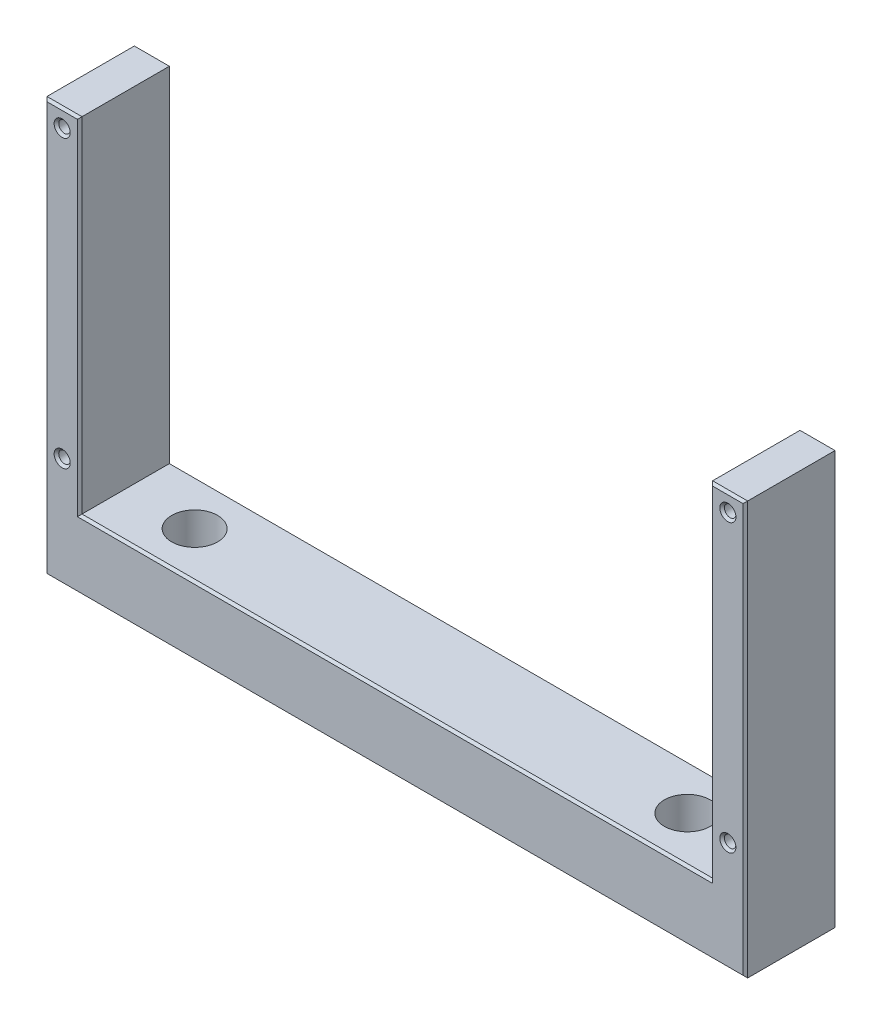
ISO-10303-21;
HEADER;
FILE_DESCRIPTION(('STEP AP214'),'2;1');
FILE_NAME('part.step','',(''),(''),'','','');
FILE_SCHEMA(('AUTOMOTIVE_DESIGN { 1 0 10303 214 1 1 1 1 }'));
ENDSEC;
DATA;
#1=APPLICATION_CONTEXT('core data for automotive mechanical design processes');
#2=APPLICATION_PROTOCOL_DEFINITION('international standard','automotive_design',2000,#1);
#3=PRODUCT_CONTEXT('',#1,'mechanical');
#4=PRODUCT('Part','Part','',(#3));
#5=PRODUCT_RELATED_PRODUCT_CATEGORY('part','',(#4));
#6=PRODUCT_DEFINITION_FORMATION('','',#4);
#7=PRODUCT_DEFINITION_CONTEXT('part definition',#1,'design');
#8=PRODUCT_DEFINITION('design','',#6,#7);
#9=PRODUCT_DEFINITION_SHAPE('','',#8);
#10=(LENGTH_UNIT() NAMED_UNIT(*) SI_UNIT(.MILLI.,.METRE.));
#11=(NAMED_UNIT(*) PLANE_ANGLE_UNIT() SI_UNIT($,.RADIAN.));
#12=(NAMED_UNIT(*) SI_UNIT($,.STERADIAN.) SOLID_ANGLE_UNIT());
#13=UNCERTAINTY_MEASURE_WITH_UNIT(LENGTH_MEASURE(1.E-05),#10,'distance_accuracy_value','');
#14=(GEOMETRIC_REPRESENTATION_CONTEXT(3) GLOBAL_UNCERTAINTY_ASSIGNED_CONTEXT((#13)) GLOBAL_UNIT_ASSIGNED_CONTEXT((#10,
#11,#12)) REPRESENTATION_CONTEXT('',''));
#15=CARTESIAN_POINT('',(0.,0.,0.));
#16=DIRECTION('',(0.,0.,1.));
#17=DIRECTION('',(1.,0.,0.));
#18=AXIS2_PLACEMENT_3D('',#15,#16,#17);
#19=CARTESIAN_POINT('',(-76.2,-54.925,20.));
#20=DIRECTION('',(1.,0.,0.));
#21=DIRECTION('',(0.,0.,-1.));
#22=AXIS2_PLACEMENT_3D('',#19,#20,#21);
#23=PLANE('',#22);
#24=DIRECTION('',(0.,0.,-1.));
#25=VECTOR('',#24,1.);
#26=CARTESIAN_POINT('',(-76.2,-54.925,20.));
#27=LINE('',#26,#25);
#28=CARTESIAN_POINT('',(-76.2,-54.925,19.5));
#29=VERTEX_POINT('',#28);
#30=CARTESIAN_POINT('',(-76.2,-54.925,0.5));
#31=VERTEX_POINT('',#30);
#32=EDGE_CURVE('E330',#29,#31,#27,.T.);
#33=ORIENTED_EDGE('',*,*,#32,.F.);
#34=DIRECTION('',(0.,1.,0.));
#35=VECTOR('',#34,1.);
#36=CARTESIAN_POINT('',(-76.2,-54.925,19.5));
#37=LINE('',#36,#35);
#38=CARTESIAN_POINT('',(-76.2,34.925,19.5));
#39=VERTEX_POINT('',#38);
#40=EDGE_CURVE('E211',#29,#39,#37,.T.);
#41=ORIENTED_EDGE('',*,*,#40,.T.);
#42=DIRECTION('',(0.,0.,-1.));
#43=VECTOR('',#42,1.);
#44=CARTESIAN_POINT('',(-76.2,34.925,20.));
#45=LINE('',#44,#43);
#46=CARTESIAN_POINT('',(-76.2,34.925,0.5));
#47=VERTEX_POINT('',#46);
#48=EDGE_CURVE('E278',#39,#47,#45,.T.);
#49=ORIENTED_EDGE('',*,*,#48,.T.);
#50=DIRECTION('',(0.,-1.,0.));
#51=VECTOR('',#50,1.);
#52=CARTESIAN_POINT('',(-76.2,-54.925,0.5));
#53=LINE('',#52,#51);
#54=EDGE_CURVE('E209',#47,#31,#53,.T.);
#55=ORIENTED_EDGE('',*,*,#54,.T.);
#56=EDGE_LOOP('',(#33,#41,#49,#55));
#57=FACE_BOUND('',#56,.T.);
#58=ADVANCED_FACE('F36',(#57),#23,.F.);
#59=CARTESIAN_POINT('',(76.2,-54.9249999999999,20.));
#60=DIRECTION('',(0.,1.,0.));
#61=DIRECTION('',(-1.,0.,0.));
#62=AXIS2_PLACEMENT_3D('',#59,#60,#61);
#63=PLANE('',#62);
#64=CARTESIAN_POINT('',(-53.5799999999999,-54.9249999999999,9.99999999999999));
#65=DIRECTION('',(0.,1.,0.));
#66=DIRECTION('',(0.,0.,1.));
#67=AXIS2_PLACEMENT_3D('',#64,#65,#66);
#68=CIRCLE('',#67,2.75);
#69=CARTESIAN_POINT('',(-53.5799999999999,-54.9249999999999,12.75));
#70=VERTEX_POINT('',#69);
#71=EDGE_CURVE('E854',#70,#70,#68,.T.);
#72=ORIENTED_EDGE('',*,*,#71,.T.);
#73=EDGE_LOOP('',(#72));
#74=FACE_BOUND('',#73,.T.);
#75=CARTESIAN_POINT('',(53.5799999999999,-54.9249999999999,9.99999999999999));
#76=DIRECTION('',(0.,1.,0.));
#77=DIRECTION('',(0.,0.,1.));
#78=AXIS2_PLACEMENT_3D('',#75,#76,#77);
#79=CIRCLE('',#78,2.75);
#80=CARTESIAN_POINT('',(53.5799999999999,-54.9249999999999,12.75));
#81=VERTEX_POINT('',#80);
#82=EDGE_CURVE('E282',#81,#81,#79,.T.);
#83=ORIENTED_EDGE('',*,*,#82,.T.);
#84=EDGE_LOOP('',(#83));
#85=FACE_BOUND('',#84,.T.);
#86=DIRECTION('',(0.,0.,-1.));
#87=VECTOR('',#86,1.);
#88=CARTESIAN_POINT('',(76.2,-54.9249999999999,20.));
#89=LINE('',#88,#87);
#90=CARTESIAN_POINT('',(76.2,-54.9249999999999,19.5));
#91=VERTEX_POINT('',#90);
#92=CARTESIAN_POINT('',(76.2,-54.9249999999999,0.5));
#93=VERTEX_POINT('',#92);
#94=EDGE_CURVE('E338',#91,#93,#89,.T.);
#95=ORIENTED_EDGE('',*,*,#94,.F.);
#96=DIRECTION('',(-1.,0.,0.));
#97=VECTOR('',#96,1.);
#98=CARTESIAN_POINT('',(76.2,-54.9249999999999,19.5));
#99=LINE('',#98,#97);
#100=EDGE_CURVE('E207',#91,#29,#99,.T.);
#101=ORIENTED_EDGE('',*,*,#100,.T.);
#102=ORIENTED_EDGE('',*,*,#32,.T.);
#103=DIRECTION('',(1.,0.,0.));
#104=VECTOR('',#103,1.);
#105=CARTESIAN_POINT('',(76.2,-54.9249999999999,0.5));
#106=LINE('',#105,#104);
#107=EDGE_CURVE('E204',#31,#93,#106,.T.);
#108=ORIENTED_EDGE('',*,*,#107,.T.);
#109=EDGE_LOOP('',(#95,#101,#102,#108));
#110=FACE_BOUND('',#109,.T.);
#111=ADVANCED_FACE('F334',(#74,#85,#110),#63,.F.);
#112=CARTESIAN_POINT('',(76.2,34.925,20.));
#113=DIRECTION('',(-1.,0.,0.));
#114=DIRECTION('',(0.,-1.,0.));
#115=AXIS2_PLACEMENT_3D('',#112,#113,#114);
#116=PLANE('',#115);
#117=DIRECTION('',(0.,0.,-1.));
#118=VECTOR('',#117,1.);
#119=CARTESIAN_POINT('',(76.2,34.925,20.));
#120=LINE('',#119,#118);
#121=CARTESIAN_POINT('',(76.2,34.925,19.5));
#122=VERTEX_POINT('',#121);
#123=CARTESIAN_POINT('',(76.2,34.925,0.5));
#124=VERTEX_POINT('',#123);
#125=EDGE_CURVE('E343',#122,#124,#120,.T.);
#126=ORIENTED_EDGE('',*,*,#125,.F.);
#127=DIRECTION('',(0.,-1.,0.));
#128=VECTOR('',#127,1.);
#129=CARTESIAN_POINT('',(76.2,34.925,19.5));
#130=LINE('',#129,#128);
#131=EDGE_CURVE('E202',#122,#91,#130,.T.);
#132=ORIENTED_EDGE('',*,*,#131,.T.);
#133=ORIENTED_EDGE('',*,*,#94,.T.);
#134=DIRECTION('',(0.,1.,0.));
#135=VECTOR('',#134,1.);
#136=CARTESIAN_POINT('',(76.2,34.925,0.5));
#137=LINE('',#136,#135);
#138=EDGE_CURVE('E200',#93,#124,#137,.T.);
#139=ORIENTED_EDGE('',*,*,#138,.T.);
#140=EDGE_LOOP('',(#126,#132,#133,#139));
#141=FACE_BOUND('',#140,.T.);
#142=ADVANCED_FACE('F424',(#141),#116,.F.);
#143=CARTESIAN_POINT('',(68.5799999999999,34.925,20.));
#144=DIRECTION('',(0.,-1.,0.));
#145=DIRECTION('',(1.,0.,0.));
#146=AXIS2_PLACEMENT_3D('',#143,#144,#145);
#147=PLANE('',#146);
#148=DIRECTION('',(0.,0.,-1.));
#149=VECTOR('',#148,1.);
#150=CARTESIAN_POINT('',(68.5799999999999,34.925,20.));
#151=LINE('',#150,#149);
#152=CARTESIAN_POINT('',(68.5799999999999,34.925,19.5));
#153=VERTEX_POINT('',#152);
#154=CARTESIAN_POINT('',(68.5799999999999,34.925,0.5));
#155=VERTEX_POINT('',#154);
#156=EDGE_CURVE('E388',#153,#155,#151,.T.);
#157=ORIENTED_EDGE('',*,*,#156,.F.);
#158=DIRECTION('',(1.,0.,0.));
#159=VECTOR('',#158,1.);
#160=CARTESIAN_POINT('',(68.5799999999999,34.925,19.5));
#161=LINE('',#160,#159);
#162=EDGE_CURVE('E198',#153,#122,#161,.T.);
#163=ORIENTED_EDGE('',*,*,#162,.T.);
#164=ORIENTED_EDGE('',*,*,#125,.T.);
#165=DIRECTION('',(-1.,0.,0.));
#166=VECTOR('',#165,1.);
#167=CARTESIAN_POINT('',(68.5799999999999,34.925,0.5));
#168=LINE('',#167,#166);
#169=EDGE_CURVE('E196',#124,#155,#168,.T.);
#170=ORIENTED_EDGE('',*,*,#169,.T.);
#171=EDGE_LOOP('',(#157,#163,#164,#170));
#172=FACE_BOUND('',#171,.T.);
#173=ADVANCED_FACE('F395',(#172),#147,.F.);
#174=CARTESIAN_POINT('',(68.5799999999999,-39.9249999999999,20.));
#175=DIRECTION('',(1.,0.,0.));
#176=DIRECTION('',(0.,0.,-1.));
#177=AXIS2_PLACEMENT_3D('',#174,#175,#176);
#178=PLANE('',#177);
#179=DIRECTION('',(0.,0.,-1.));
#180=VECTOR('',#179,1.);
#181=CARTESIAN_POINT('',(68.5799999999999,-39.9249999999999,20.));
#182=LINE('',#181,#180);
#183=CARTESIAN_POINT('',(68.5799999999999,-39.9249999999999,19.5));
#184=VERTEX_POINT('',#183);
#185=CARTESIAN_POINT('',(68.5799999999999,-39.9249999999999,0.5));
#186=VERTEX_POINT('',#185);
#187=EDGE_CURVE('E381',#184,#186,#182,.T.);
#188=ORIENTED_EDGE('',*,*,#187,.F.);
#189=DIRECTION('',(0.,1.,0.));
#190=VECTOR('',#189,1.);
#191=CARTESIAN_POINT('',(68.5799999999999,-39.9249999999999,19.5));
#192=LINE('',#191,#190);
#193=EDGE_CURVE('E194',#184,#153,#192,.T.);
#194=ORIENTED_EDGE('',*,*,#193,.T.);
#195=ORIENTED_EDGE('',*,*,#156,.T.);
#196=DIRECTION('',(0.,-1.,0.));
#197=VECTOR('',#196,1.);
#198=CARTESIAN_POINT('',(68.5799999999999,-39.9249999999999,0.5));
#199=LINE('',#198,#197);
#200=EDGE_CURVE('E192',#155,#186,#199,.T.);
#201=ORIENTED_EDGE('',*,*,#200,.T.);
#202=EDGE_LOOP('',(#188,#194,#195,#201));
#203=FACE_BOUND('',#202,.T.);
#204=ADVANCED_FACE('F493',(#203),#178,.F.);
#205=CARTESIAN_POINT('',(-68.5799999999999,-39.925,20.));
#206=DIRECTION('',(0.,-1.,0.));
#207=DIRECTION('',(1.,0.,0.));
#208=AXIS2_PLACEMENT_3D('',#205,#206,#207);
#209=PLANE('',#208);
#210=CARTESIAN_POINT('',(-53.5799999999999,-39.9249999999999,9.99999999999999));
#211=DIRECTION('',(0.,1.,0.));
#212=DIRECTION('',(0.,0.,1.));
#213=AXIS2_PLACEMENT_3D('',#210,#211,#212);
#214=CIRCLE('',#213,5.);
#215=CARTESIAN_POINT('',(-53.5799999999999,-39.9249999999999,15.));
#216=VERTEX_POINT('',#215);
#217=EDGE_CURVE('E847',#216,#216,#214,.T.);
#218=ORIENTED_EDGE('',*,*,#217,.F.);
#219=EDGE_LOOP('',(#218));
#220=FACE_BOUND('',#219,.T.);
#221=CARTESIAN_POINT('',(53.5799999999999,-39.9249999999999,9.99999999999999));
#222=DIRECTION('',(0.,1.,0.));
#223=DIRECTION('',(0.,0.,1.));
#224=AXIS2_PLACEMENT_3D('',#221,#222,#223);
#225=CIRCLE('',#224,5.);
#226=CARTESIAN_POINT('',(53.5799999999999,-39.9249999999999,15.));
#227=VERTEX_POINT('',#226);
#228=EDGE_CURVE('E857',#227,#227,#225,.T.);
#229=ORIENTED_EDGE('',*,*,#228,.F.);
#230=EDGE_LOOP('',(#229));
#231=FACE_BOUND('',#230,.T.);
#232=DIRECTION('',(0.,0.,-1.));
#233=VECTOR('',#232,1.);
#234=CARTESIAN_POINT('',(-68.5799999999999,-39.925,20.));
#235=LINE('',#234,#233);
#236=CARTESIAN_POINT('',(-68.5799999999999,-39.925,19.5));
#237=VERTEX_POINT('',#236);
#238=CARTESIAN_POINT('',(-68.5799999999999,-39.925,0.5));
#239=VERTEX_POINT('',#238);
#240=EDGE_CURVE('E379',#237,#239,#235,.T.);
#241=ORIENTED_EDGE('',*,*,#240,.F.);
#242=DIRECTION('',(1.,0.,0.));
#243=VECTOR('',#242,1.);
#244=CARTESIAN_POINT('',(-68.5799999999999,-39.925,19.5));
#245=LINE('',#244,#243);
#246=EDGE_CURVE('E190',#237,#184,#245,.T.);
#247=ORIENTED_EDGE('',*,*,#246,.T.);
#248=ORIENTED_EDGE('',*,*,#187,.T.);
#249=DIRECTION('',(-1.,0.,0.));
#250=VECTOR('',#249,1.);
#251=CARTESIAN_POINT('',(-68.5799999999999,-39.925,0.5));
#252=LINE('',#251,#250);
#253=EDGE_CURVE('E188',#186,#239,#252,.T.);
#254=ORIENTED_EDGE('',*,*,#253,.T.);
#255=EDGE_LOOP('',(#241,#247,#248,#254));
#256=FACE_BOUND('',#255,.T.);
#257=ADVANCED_FACE('F490',(#220,#231,#256),#209,.F.);
#258=CARTESIAN_POINT('',(-68.5799999999999,34.925,20.));
#259=DIRECTION('',(-1.,0.,0.));
#260=DIRECTION('',(0.,-1.,0.));
#261=AXIS2_PLACEMENT_3D('',#258,#259,#260);
#262=PLANE('',#261);
#263=DIRECTION('',(0.,0.,-1.));
#264=VECTOR('',#263,1.);
#265=CARTESIAN_POINT('',(-68.5799999999999,34.925,20.));
#266=LINE('',#265,#264);
#267=CARTESIAN_POINT('',(-68.5799999999999,34.925,19.5));
#268=VERTEX_POINT('',#267);
#269=CARTESIAN_POINT('',(-68.5799999999999,34.925,0.5));
#270=VERTEX_POINT('',#269);
#271=EDGE_CURVE('E377',#268,#270,#266,.T.);
#272=ORIENTED_EDGE('',*,*,#271,.F.);
#273=DIRECTION('',(0.,-1.,0.));
#274=VECTOR('',#273,1.);
#275=CARTESIAN_POINT('',(-68.5799999999999,34.925,19.5));
#276=LINE('',#275,#274);
#277=EDGE_CURVE('E186',#268,#237,#276,.T.);
#278=ORIENTED_EDGE('',*,*,#277,.T.);
#279=ORIENTED_EDGE('',*,*,#240,.T.);
#280=DIRECTION('',(0.,1.,0.));
#281=VECTOR('',#280,1.);
#282=CARTESIAN_POINT('',(-68.5799999999999,34.925,0.5));
#283=LINE('',#282,#281);
#284=EDGE_CURVE('E184',#239,#270,#283,.T.);
#285=ORIENTED_EDGE('',*,*,#284,.T.);
#286=EDGE_LOOP('',(#272,#278,#279,#285));
#287=FACE_BOUND('',#286,.T.);
#288=ADVANCED_FACE('F378',(#287),#262,.F.);
#289=CARTESIAN_POINT('',(-76.2,34.925,20.));
#290=DIRECTION('',(0.,-1.,0.));
#291=DIRECTION('',(0.,0.,-1.));
#292=AXIS2_PLACEMENT_3D('',#289,#290,#291);
#293=PLANE('',#292);
#294=ORIENTED_EDGE('',*,*,#48,.F.);
#295=DIRECTION('',(1.,0.,0.));
#296=VECTOR('',#295,1.);
#297=CARTESIAN_POINT('',(-76.2,34.925,19.5));
#298=LINE('',#297,#296);
#299=EDGE_CURVE('E156',#39,#268,#298,.T.);
#300=ORIENTED_EDGE('',*,*,#299,.T.);
#301=ORIENTED_EDGE('',*,*,#271,.T.);
#302=DIRECTION('',(-1.,0.,0.));
#303=VECTOR('',#302,1.);
#304=CARTESIAN_POINT('',(-76.2,34.925,0.5));
#305=LINE('',#304,#303);
#306=EDGE_CURVE('E176',#270,#47,#305,.T.);
#307=ORIENTED_EDGE('',*,*,#306,.T.);
#308=EDGE_LOOP('',(#294,#300,#301,#307));
#309=FACE_BOUND('',#308,.T.);
#310=ADVANCED_FACE('F376',(#309),#293,.F.);
#311=CARTESIAN_POINT('',(0.,0.,20.));
#312=DIRECTION('',(0.,0.,-1.));
#313=DIRECTION('',(-1.,0.,0.));
#314=AXIS2_PLACEMENT_3D('',#311,#312,#313);
#315=PLANE('',#314);
#316=DIRECTION('',(0.,1.,0.));
#317=VECTOR('',#316,1.);
#318=CARTESIAN_POINT('',(-69.0799999999999,0.,20.));
#319=LINE('',#318,#317);
#320=CARTESIAN_POINT('',(-69.0799999999999,-40.425,20.));
#321=VERTEX_POINT('',#320);
#322=CARTESIAN_POINT('',(-69.0799999999999,34.425,20.));
#323=VERTEX_POINT('',#322);
#324=EDGE_CURVE('E174',#321,#323,#319,.T.);
#325=ORIENTED_EDGE('',*,*,#324,.T.);
#326=DIRECTION('',(-1.,0.,0.));
#327=VECTOR('',#326,1.);
#328=CARTESIAN_POINT('',(0.,34.425,20.));
#329=LINE('',#328,#327);
#330=CARTESIAN_POINT('',(-75.7,34.425,20.));
#331=VERTEX_POINT('',#330);
#332=EDGE_CURVE('E154',#323,#331,#329,.T.);
#333=ORIENTED_EDGE('',*,*,#332,.T.);
#334=DIRECTION('',(0.,-1.,0.));
#335=VECTOR('',#334,1.);
#336=CARTESIAN_POINT('',(-75.7,0.,20.));
#337=LINE('',#336,#335);
#338=CARTESIAN_POINT('',(-75.7,-54.4249999999999,20.));
#339=VERTEX_POINT('',#338);
#340=EDGE_CURVE('E162',#331,#339,#337,.T.);
#341=ORIENTED_EDGE('',*,*,#340,.T.);
#342=DIRECTION('',(1.,0.,0.));
#343=VECTOR('',#342,1.);
#344=CARTESIAN_POINT('',(0.,-54.4249999999999,20.));
#345=LINE('',#344,#343);
#346=CARTESIAN_POINT('',(75.7,-54.4249999999999,20.));
#347=VERTEX_POINT('',#346);
#348=EDGE_CURVE('E168',#339,#347,#345,.T.);
#349=ORIENTED_EDGE('',*,*,#348,.T.);
#350=DIRECTION('',(0.,1.,0.));
#351=VECTOR('',#350,1.);
#352=CARTESIAN_POINT('',(75.7,0.,20.));
#353=LINE('',#352,#351);
#354=CARTESIAN_POINT('',(75.7,34.425,20.));
#355=VERTEX_POINT('',#354);
#356=EDGE_CURVE('E355',#347,#355,#353,.T.);
#357=ORIENTED_EDGE('',*,*,#356,.T.);
#358=DIRECTION('',(-1.,0.,0.));
#359=VECTOR('',#358,1.);
#360=CARTESIAN_POINT('',(0.,34.4249999999999,20.));
#361=LINE('',#360,#359);
#362=CARTESIAN_POINT('',(69.0799999999999,34.425,20.));
#363=VERTEX_POINT('',#362);
#364=EDGE_CURVE('E357',#355,#363,#361,.T.);
#365=ORIENTED_EDGE('',*,*,#364,.T.);
#366=DIRECTION('',(0.,-1.,0.));
#367=VECTOR('',#366,1.);
#368=CARTESIAN_POINT('',(69.0799999999999,0.,20.));
#369=LINE('',#368,#367);
#370=CARTESIAN_POINT('',(69.0799999999999,-40.425,20.));
#371=VERTEX_POINT('',#370);
#372=EDGE_CURVE('E359',#363,#371,#369,.T.);
#373=ORIENTED_EDGE('',*,*,#372,.T.);
#374=DIRECTION('',(-1.,0.,0.));
#375=VECTOR('',#374,1.);
#376=CARTESIAN_POINT('',(0.,-40.425,20.));
#377=LINE('',#376,#375);
#378=EDGE_CURVE('E179',#371,#321,#377,.T.);
#379=ORIENTED_EDGE('',*,*,#378,.T.);
#380=EDGE_LOOP('',(#325,#333,#341,#349,#357,#365,#373,#379));
#381=FACE_BOUND('',#380,.T.);
#382=CARTESIAN_POINT('',(-72.39,-31.115,20.));
#383=DIRECTION('',(0.,0.,-1.));
#384=DIRECTION('',(-1.,0.,0.));
#385=AXIS2_PLACEMENT_3D('',#382,#383,#384);
#386=CIRCLE('',#385,1.75);
#387=CARTESIAN_POINT('',(-74.14,-31.115,20.));
#388=VERTEX_POINT('',#387);
#389=EDGE_CURVE('E169',#388,#388,#386,.T.);
#390=ORIENTED_EDGE('',*,*,#389,.T.);
#391=EDGE_LOOP('',(#390));
#392=FACE_BOUND('',#391,.T.);
#393=CARTESIAN_POINT('',(-72.39,31.115,20.));
#394=DIRECTION('',(0.,0.,-1.));
#395=DIRECTION('',(-1.,0.,0.));
#396=AXIS2_PLACEMENT_3D('',#393,#394,#395);
#397=CIRCLE('',#396,1.75);
#398=CARTESIAN_POINT('',(-74.14,31.115,20.));
#399=VERTEX_POINT('',#398);
#400=EDGE_CURVE('E349',#399,#399,#397,.T.);
#401=ORIENTED_EDGE('',*,*,#400,.T.);
#402=EDGE_LOOP('',(#401));
#403=FACE_BOUND('',#402,.T.);
#404=CARTESIAN_POINT('',(72.39,31.115,20.));
#405=DIRECTION('',(0.,0.,-1.));
#406=DIRECTION('',(-1.,0.,0.));
#407=AXIS2_PLACEMENT_3D('',#404,#405,#406);
#408=CIRCLE('',#407,1.75);
#409=CARTESIAN_POINT('',(70.64,31.115,20.));
#410=VERTEX_POINT('',#409);
#411=EDGE_CURVE('E341',#410,#410,#408,.T.);
#412=ORIENTED_EDGE('',*,*,#411,.T.);
#413=EDGE_LOOP('',(#412));
#414=FACE_BOUND('',#413,.T.);
#415=CARTESIAN_POINT('',(72.39,-31.115,20.));
#416=DIRECTION('',(0.,0.,-1.));
#417=DIRECTION('',(-1.,0.,0.));
#418=AXIS2_PLACEMENT_3D('',#415,#416,#417);
#419=CIRCLE('',#418,1.75);
#420=CARTESIAN_POINT('',(70.64,-31.115,20.));
#421=VERTEX_POINT('',#420);
#422=EDGE_CURVE('E337',#421,#421,#419,.T.);
#423=ORIENTED_EDGE('',*,*,#422,.T.);
#424=EDGE_LOOP('',(#423));
#425=FACE_BOUND('',#424,.T.);
#426=ADVANCED_FACE('F171',(#381,#392,#403,#414,#425),#315,.F.);
#427=CARTESIAN_POINT('',(0.,0.,0.));
#428=DIRECTION('',(0.,0.,-1.));
#429=DIRECTION('',(-1.,0.,0.));
#430=AXIS2_PLACEMENT_3D('',#427,#428,#429);
#431=PLANE('',#430);
#432=DIRECTION('',(0.,-1.,0.));
#433=VECTOR('',#432,1.);
#434=CARTESIAN_POINT('',(75.7,-54.9249999999999,0.));
#435=LINE('',#434,#433);
#436=CARTESIAN_POINT('',(75.7,34.425,0.));
#437=VERTEX_POINT('',#436);
#438=CARTESIAN_POINT('',(75.7,-54.4249999999999,0.));
#439=VERTEX_POINT('',#438);
#440=EDGE_CURVE('E45',#437,#439,#435,.T.);
#441=ORIENTED_EDGE('',*,*,#440,.T.);
#442=DIRECTION('',(-1.,0.,0.));
#443=VECTOR('',#442,1.);
#444=CARTESIAN_POINT('',(-76.2,-54.4249999999999,0.));
#445=LINE('',#444,#443);
#446=CARTESIAN_POINT('',(-75.7,-54.4249999999999,0.));
#447=VERTEX_POINT('',#446);
#448=EDGE_CURVE('E11',#439,#447,#445,.T.);
#449=ORIENTED_EDGE('',*,*,#448,.T.);
#450=DIRECTION('',(0.,1.,0.));
#451=VECTOR('',#450,1.);
#452=CARTESIAN_POINT('',(-75.7,34.925,0.));
#453=LINE('',#452,#451);
#454=CARTESIAN_POINT('',(-75.7,34.425,0.));
#455=VERTEX_POINT('',#454);
#456=EDGE_CURVE('E249',#447,#455,#453,.T.);
#457=ORIENTED_EDGE('',*,*,#456,.T.);
#458=DIRECTION('',(1.,0.,0.));
#459=VECTOR('',#458,1.);
#460=CARTESIAN_POINT('',(-68.5799999999999,34.425,0.));
#461=LINE('',#460,#459);
#462=CARTESIAN_POINT('',(-69.0799999999999,34.425,0.));
#463=VERTEX_POINT('',#462);
#464=EDGE_CURVE('E251',#455,#463,#461,.T.);
#465=ORIENTED_EDGE('',*,*,#464,.T.);
#466=DIRECTION('',(0.,-1.,0.));
#467=VECTOR('',#466,1.);
#468=CARTESIAN_POINT('',(-69.0799999999999,-39.925,0.));
#469=LINE('',#468,#467);
#470=CARTESIAN_POINT('',(-69.0799999999999,-40.425,0.));
#471=VERTEX_POINT('',#470);
#472=EDGE_CURVE('E253',#463,#471,#469,.T.);
#473=ORIENTED_EDGE('',*,*,#472,.T.);
#474=DIRECTION('',(1.,0.,0.));
#475=VECTOR('',#474,1.);
#476=CARTESIAN_POINT('',(68.5799999999999,-40.425,0.));
#477=LINE('',#476,#475);
#478=CARTESIAN_POINT('',(69.0799999999999,-40.425,0.));
#479=VERTEX_POINT('',#478);
#480=EDGE_CURVE('E255',#471,#479,#477,.T.);
#481=ORIENTED_EDGE('',*,*,#480,.T.);
#482=DIRECTION('',(0.,1.,0.));
#483=VECTOR('',#482,1.);
#484=CARTESIAN_POINT('',(69.0799999999999,34.925,0.));
#485=LINE('',#484,#483);
#486=CARTESIAN_POINT('',(69.0799999999999,34.425,0.));
#487=VERTEX_POINT('',#486);
#488=EDGE_CURVE('E257',#479,#487,#485,.T.);
#489=ORIENTED_EDGE('',*,*,#488,.T.);
#490=DIRECTION('',(1.,0.,0.));
#491=VECTOR('',#490,1.);
#492=CARTESIAN_POINT('',(76.2,34.425,0.));
#493=LINE('',#492,#491);
#494=EDGE_CURVE('E56',#487,#437,#493,.T.);
#495=ORIENTED_EDGE('',*,*,#494,.T.);
#496=EDGE_LOOP('',(#441,#449,#457,#465,#473,#481,#489,#495));
#497=FACE_BOUND('',#496,.T.);
#498=CARTESIAN_POINT('',(-72.39,-31.115,0.));
#499=DIRECTION('',(0.,0.,-1.));
#500=DIRECTION('',(-1.,0.,0.));
#501=AXIS2_PLACEMENT_3D('',#498,#499,#500);
#502=CIRCLE('',#501,1.75000000000003);
#503=CARTESIAN_POINT('',(-74.14,-31.115,0.));
#504=VERTEX_POINT('',#503);
#505=EDGE_CURVE('E246',#504,#504,#502,.F.);
#506=ORIENTED_EDGE('',*,*,#505,.T.);
#507=EDGE_LOOP('',(#506));
#508=FACE_BOUND('',#507,.T.);
#509=CARTESIAN_POINT('',(-72.39,31.115,0.));
#510=DIRECTION('',(0.,0.,-1.));
#511=DIRECTION('',(-1.,0.,0.));
#512=AXIS2_PLACEMENT_3D('',#509,#510,#511);
#513=CIRCLE('',#512,1.75000000000003);
#514=CARTESIAN_POINT('',(-74.14,31.115,0.));
#515=VERTEX_POINT('',#514);
#516=EDGE_CURVE('E243',#515,#515,#513,.F.);
#517=ORIENTED_EDGE('',*,*,#516,.T.);
#518=EDGE_LOOP('',(#517));
#519=FACE_BOUND('',#518,.T.);
#520=CARTESIAN_POINT('',(72.39,31.115,0.));
#521=DIRECTION('',(0.,0.,-1.));
#522=DIRECTION('',(-1.,0.,0.));
#523=AXIS2_PLACEMENT_3D('',#520,#521,#522);
#524=CIRCLE('',#523,1.75000000000003);
#525=CARTESIAN_POINT('',(70.64,31.115,0.));
#526=VERTEX_POINT('',#525);
#527=EDGE_CURVE('E240',#526,#526,#524,.F.);
#528=ORIENTED_EDGE('',*,*,#527,.T.);
#529=EDGE_LOOP('',(#528));
#530=FACE_BOUND('',#529,.T.);
#531=CARTESIAN_POINT('',(72.39,-31.115,0.));
#532=DIRECTION('',(0.,0.,-1.));
#533=DIRECTION('',(-1.,0.,0.));
#534=AXIS2_PLACEMENT_3D('',#531,#532,#533);
#535=CIRCLE('',#534,1.75000000000003);
#536=CARTESIAN_POINT('',(70.64,-31.115,0.));
#537=VERTEX_POINT('',#536);
#538=EDGE_CURVE('E237',#537,#537,#535,.F.);
#539=ORIENTED_EDGE('',*,*,#538,.T.);
#540=EDGE_LOOP('',(#539));
#541=FACE_BOUND('',#540,.T.);
#542=ADVANCED_FACE('F312',(#497,#508,#519,#530,#541),#431,.T.);
#543=CARTESIAN_POINT('',(-72.39,-31.115,0.));
#544=DIRECTION('',(0.,0.,-1.));
#545=DIRECTION('',(-1.,0.,0.));
#546=AXIS2_PLACEMENT_3D('',#543,#544,#545);
#547=CYLINDRICAL_SURFACE('',#546,1.25);
#548=CARTESIAN_POINT('',(-72.39,-31.115,19.5));
#549=DIRECTION('',(0.,0.,-1.));
#550=DIRECTION('',(-1.,0.,0.));
#551=AXIS2_PLACEMENT_3D('',#548,#549,#550);
#552=CIRCLE('',#551,1.25);
#553=CARTESIAN_POINT('',(-73.64,-31.115,19.5));
#554=VERTEX_POINT('',#553);
#555=EDGE_CURVE('E216',#554,#554,#552,.F.);
#556=ORIENTED_EDGE('',*,*,#555,.T.);
#557=EDGE_LOOP('',(#556));
#558=FACE_BOUND('',#557,.T.);
#559=CARTESIAN_POINT('',(-72.39,-31.115,0.500000000000005));
#560=DIRECTION('',(0.,0.,-1.));
#561=DIRECTION('',(-1.,0.,0.));
#562=AXIS2_PLACEMENT_3D('',#559,#560,#561);
#563=CIRCLE('',#562,1.25);
#564=CARTESIAN_POINT('',(-73.64,-31.115,0.500000000000005));
#565=VERTEX_POINT('',#564);
#566=EDGE_CURVE('E213',#565,#565,#563,.T.);
#567=ORIENTED_EDGE('',*,*,#566,.T.);
#568=EDGE_LOOP('',(#567));
#569=FACE_BOUND('',#568,.T.);
#570=ADVANCED_FACE('F482',(#558,#569),#547,.F.);
#571=CARTESIAN_POINT('',(-72.39,31.115,0.));
#572=DIRECTION('',(0.,0.,-1.));
#573=DIRECTION('',(-1.,0.,0.));
#574=AXIS2_PLACEMENT_3D('',#571,#572,#573);
#575=CYLINDRICAL_SURFACE('',#574,1.25);
#576=CARTESIAN_POINT('',(-72.39,31.115,19.5));
#577=DIRECTION('',(0.,0.,-1.));
#578=DIRECTION('',(-1.,0.,0.));
#579=AXIS2_PLACEMENT_3D('',#576,#577,#578);
#580=CIRCLE('',#579,1.25);
#581=CARTESIAN_POINT('',(-73.64,31.115,19.5));
#582=VERTEX_POINT('',#581);
#583=EDGE_CURVE('E222',#582,#582,#580,.F.);
#584=ORIENTED_EDGE('',*,*,#583,.T.);
#585=EDGE_LOOP('',(#584));
#586=FACE_BOUND('',#585,.T.);
#587=CARTESIAN_POINT('',(-72.39,31.115,0.500000000000005));
#588=DIRECTION('',(0.,0.,-1.));
#589=DIRECTION('',(-1.,0.,0.));
#590=AXIS2_PLACEMENT_3D('',#587,#588,#589);
#591=CIRCLE('',#590,1.25);
#592=CARTESIAN_POINT('',(-73.64,31.115,0.500000000000005));
#593=VERTEX_POINT('',#592);
#594=EDGE_CURVE('E219',#593,#593,#591,.T.);
#595=ORIENTED_EDGE('',*,*,#594,.T.);
#596=EDGE_LOOP('',(#595));
#597=FACE_BOUND('',#596,.T.);
#598=ADVANCED_FACE('F550',(#586,#597),#575,.F.);
#599=CARTESIAN_POINT('',(72.39,31.115,0.));
#600=DIRECTION('',(0.,0.,-1.));
#601=DIRECTION('',(-1.,0.,0.));
#602=AXIS2_PLACEMENT_3D('',#599,#600,#601);
#603=CYLINDRICAL_SURFACE('',#602,1.25);
#604=CARTESIAN_POINT('',(72.39,31.115,19.5));
#605=DIRECTION('',(0.,0.,-1.));
#606=DIRECTION('',(-1.,0.,0.));
#607=AXIS2_PLACEMENT_3D('',#604,#605,#606);
#608=CIRCLE('',#607,1.25);
#609=CARTESIAN_POINT('',(71.14,31.115,19.5));
#610=VERTEX_POINT('',#609);
#611=EDGE_CURVE('E228',#610,#610,#608,.F.);
#612=ORIENTED_EDGE('',*,*,#611,.T.);
#613=EDGE_LOOP('',(#612));
#614=FACE_BOUND('',#613,.T.);
#615=CARTESIAN_POINT('',(72.39,31.115,0.500000000000005));
#616=DIRECTION('',(0.,0.,-1.));
#617=DIRECTION('',(-1.,0.,0.));
#618=AXIS2_PLACEMENT_3D('',#615,#616,#617);
#619=CIRCLE('',#618,1.25);
#620=CARTESIAN_POINT('',(71.14,31.115,0.500000000000005));
#621=VERTEX_POINT('',#620);
#622=EDGE_CURVE('E225',#621,#621,#619,.T.);
#623=ORIENTED_EDGE('',*,*,#622,.T.);
#624=EDGE_LOOP('',(#623));
#625=FACE_BOUND('',#624,.T.);
#626=ADVANCED_FACE('F561',(#614,#625),#603,.F.);
#627=CARTESIAN_POINT('',(72.39,-31.115,0.));
#628=DIRECTION('',(0.,0.,-1.));
#629=DIRECTION('',(-1.,0.,0.));
#630=AXIS2_PLACEMENT_3D('',#627,#628,#629);
#631=CYLINDRICAL_SURFACE('',#630,1.25);
#632=CARTESIAN_POINT('',(72.39,-31.115,19.5));
#633=DIRECTION('',(0.,0.,-1.));
#634=DIRECTION('',(-1.,0.,0.));
#635=AXIS2_PLACEMENT_3D('',#632,#633,#634);
#636=CIRCLE('',#635,1.25);
#637=CARTESIAN_POINT('',(71.14,-31.115,19.5));
#638=VERTEX_POINT('',#637);
#639=EDGE_CURVE('E234',#638,#638,#636,.F.);
#640=ORIENTED_EDGE('',*,*,#639,.T.);
#641=EDGE_LOOP('',(#640));
#642=FACE_BOUND('',#641,.T.);
#643=CARTESIAN_POINT('',(72.39,-31.115,0.500000000000005));
#644=DIRECTION('',(0.,0.,-1.));
#645=DIRECTION('',(-1.,0.,0.));
#646=AXIS2_PLACEMENT_3D('',#643,#644,#645);
#647=CIRCLE('',#646,1.25);
#648=CARTESIAN_POINT('',(71.14,-31.115,0.500000000000005));
#649=VERTEX_POINT('',#648);
#650=EDGE_CURVE('E231',#649,#649,#647,.T.);
#651=ORIENTED_EDGE('',*,*,#650,.T.);
#652=EDGE_LOOP('',(#651));
#653=FACE_BOUND('',#652,.T.);
#654=ADVANCED_FACE('F453',(#642,#653),#631,.F.);
#655=CARTESIAN_POINT('',(0.,34.4249999999999,20.));
#656=DIRECTION('',(0.,-0.707106781186553,-0.707106781186543));
#657=DIRECTION('',(-1.,0.,0.));
#658=AXIS2_PLACEMENT_3D('',#655,#656,#657);
#659=PLANE('',#658);
#660=DIRECTION('',(-0.577350269189622,-0.577350269189624,0.577350269189632));
#661=VECTOR('',#660,1.);
#662=CARTESIAN_POINT('',(64.2250000000001,22.9500000000001,31.4750000000001));
#663=LINE('',#662,#661);
#664=EDGE_CURVE('E272',#122,#355,#663,.T.);
#665=ORIENTED_EDGE('',*,*,#664,.F.);
#666=ORIENTED_EDGE('',*,*,#162,.F.);
#667=DIRECTION('',(0.577350269189629,-0.57735026918962,0.577350269189629));
#668=VECTOR('',#667,1.);
#669=CARTESIAN_POINT('',(46.0533333333331,57.4516666666665,-3.02666666666685));
#670=LINE('',#669,#668);
#671=EDGE_CURVE('E275',#363,#153,#670,.F.);
#672=ORIENTED_EDGE('',*,*,#671,.F.);
#673=ORIENTED_EDGE('',*,*,#364,.F.);
#674=EDGE_LOOP('',(#665,#666,#672,#673));
#675=FACE_BOUND('',#674,.T.);
#676=ADVANCED_FACE('F449',(#675),#659,.F.);
#677=CARTESIAN_POINT('',(69.0799999999999,0.,20.));
#678=DIRECTION('',(0.707106781186548,0.,-0.707106781186548));
#679=DIRECTION('',(0.,-1.,0.));
#680=AXIS2_PLACEMENT_3D('',#677,#678,#679);
#681=PLANE('',#680);
#682=ORIENTED_EDGE('',*,*,#671,.T.);
#683=ORIENTED_EDGE('',*,*,#193,.F.);
#684=DIRECTION('',(0.57735026918963,-0.577350269189618,0.57735026918963));
#685=VECTOR('',#684,1.);
#686=CARTESIAN_POINT('',(46.0533333333329,-17.3983333333335,-3.02666666666695));
#687=LINE('',#686,#685);
#688=EDGE_CURVE('E269',#371,#184,#687,.F.);
#689=ORIENTED_EDGE('',*,*,#688,.F.);
#690=ORIENTED_EDGE('',*,*,#372,.F.);
#691=EDGE_LOOP('',(#682,#683,#689,#690));
#692=FACE_BOUND('',#691,.T.);
#693=ADVANCED_FACE('F445',(#692),#681,.F.);
#694=CARTESIAN_POINT('',(75.7,0.,20.));
#695=DIRECTION('',(-0.707106781186553,0.,-0.707106781186541));
#696=DIRECTION('',(0.,1.,0.));
#697=AXIS2_PLACEMENT_3D('',#694,#695,#696);
#698=PLANE('',#697);
#699=ORIENTED_EDGE('',*,*,#664,.T.);
#700=ORIENTED_EDGE('',*,*,#356,.F.);
#701=DIRECTION('',(-0.577350269189618,0.577350269189632,0.577350269189628));
#702=VECTOR('',#701,1.);
#703=CARTESIAN_POINT('',(50.4666666666673,-29.1916666666667,45.2333333333331));
#704=LINE('',#703,#702);
#705=EDGE_CURVE('E266',#91,#347,#704,.T.);
#706=ORIENTED_EDGE('',*,*,#705,.F.);
#707=ORIENTED_EDGE('',*,*,#131,.F.);
#708=EDGE_LOOP('',(#699,#700,#706,#707));
#709=FACE_BOUND('',#708,.T.);
#710=ADVANCED_FACE('F442',(#709),#698,.F.);
#711=CARTESIAN_POINT('',(0.,-40.425,20.));
#712=DIRECTION('',(0.,-0.707106781186555,-0.70710678118654));
#713=DIRECTION('',(-1.,0.,0.));
#714=AXIS2_PLACEMENT_3D('',#711,#712,#713);
#715=PLANE('',#714);
#716=ORIENTED_EDGE('',*,*,#688,.T.);
#717=ORIENTED_EDGE('',*,*,#246,.F.);
#718=DIRECTION('',(-0.577350269189624,-0.577350269189621,0.577350269189633));
#719=VECTOR('',#718,1.);
#720=CARTESIAN_POINT('',(-55.6050000000001,-26.9500000000002,6.52499999999997));
#721=LINE('',#720,#719);
#722=EDGE_CURVE('E263',#321,#237,#721,.F.);
#723=ORIENTED_EDGE('',*,*,#722,.F.);
#724=ORIENTED_EDGE('',*,*,#378,.F.);
#725=EDGE_LOOP('',(#716,#717,#723,#724));
#726=FACE_BOUND('',#725,.T.);
#727=ADVANCED_FACE('F366',(#726),#715,.F.);
#728=CARTESIAN_POINT('',(0.,-54.4249999999999,20.));
#729=DIRECTION('',(0.,0.707106781186545,-0.70710678118655));
#730=DIRECTION('',(1.,0.,0.));
#731=AXIS2_PLACEMENT_3D('',#728,#729,#730);
#732=PLANE('',#731);
#733=ORIENTED_EDGE('',*,*,#705,.T.);
#734=ORIENTED_EDGE('',*,*,#348,.F.);
#735=DIRECTION('',(0.577350269189624,0.577350269189629,0.577350269189624));
#736=VECTOR('',#735,1.);
#737=CARTESIAN_POINT('',(-57.5583333333333,-36.2833333333331,38.1416666666667));
#738=LINE('',#737,#736);
#739=EDGE_CURVE('E165',#29,#339,#738,.T.);
#740=ORIENTED_EDGE('',*,*,#739,.F.);
#741=ORIENTED_EDGE('',*,*,#100,.F.);
#742=EDGE_LOOP('',(#733,#734,#740,#741));
#743=FACE_BOUND('',#742,.T.);
#744=ADVANCED_FACE('F436',(#743),#732,.F.);
#745=CARTESIAN_POINT('',(-69.0799999999999,0.,20.));
#746=DIRECTION('',(-0.707106781186553,0.,-0.707106781186542));
#747=DIRECTION('',(0.,1.,0.));
#748=AXIS2_PLACEMENT_3D('',#745,#746,#747);
#749=PLANE('',#748);
#750=ORIENTED_EDGE('',*,*,#722,.T.);
#751=ORIENTED_EDGE('',*,*,#277,.F.);
#752=DIRECTION('',(-0.57735026918962,-0.577350269189629,0.577350269189629));
#753=VECTOR('',#752,1.);
#754=CARTESIAN_POINT('',(-80.5549999999999,22.9499999999999,31.4750000000001));
#755=LINE('',#754,#753);
#756=EDGE_CURVE('E159',#323,#268,#755,.F.);
#757=ORIENTED_EDGE('',*,*,#756,.F.);
#758=ORIENTED_EDGE('',*,*,#324,.F.);
#759=EDGE_LOOP('',(#750,#751,#757,#758));
#760=FACE_BOUND('',#759,.T.);
#761=ADVANCED_FACE('F369',(#760),#749,.F.);
#762=CARTESIAN_POINT('',(-75.7,0.,20.));
#763=DIRECTION('',(0.707106781186548,0.,-0.707106781186548));
#764=DIRECTION('',(0.,-1.,0.));
#765=AXIS2_PLACEMENT_3D('',#762,#763,#764);
#766=PLANE('',#765);
#767=ORIENTED_EDGE('',*,*,#739,.T.);
#768=ORIENTED_EDGE('',*,*,#340,.F.);
#769=DIRECTION('',(-0.577350269189626,0.577350269189626,-0.577350269189626));
#770=VECTOR('',#769,1.);
#771=CARTESIAN_POINT('',(-64.225,22.95,31.475));
#772=LINE('',#771,#770);
#773=EDGE_CURVE('E150',#39,#331,#772,.F.);
#774=ORIENTED_EDGE('',*,*,#773,.F.);
#775=ORIENTED_EDGE('',*,*,#40,.F.);
#776=EDGE_LOOP('',(#767,#768,#774,#775));
#777=FACE_BOUND('',#776,.T.);
#778=ADVANCED_FACE('F163',(#777),#766,.F.);
#779=CARTESIAN_POINT('',(0.,34.425,20.));
#780=DIRECTION('',(0.,-0.707106781186548,-0.707106781186548));
#781=DIRECTION('',(-1.,0.,0.));
#782=AXIS2_PLACEMENT_3D('',#779,#780,#781);
#783=PLANE('',#782);
#784=ORIENTED_EDGE('',*,*,#756,.T.);
#785=ORIENTED_EDGE('',*,*,#299,.F.);
#786=ORIENTED_EDGE('',*,*,#773,.T.);
#787=ORIENTED_EDGE('',*,*,#332,.F.);
#788=EDGE_LOOP('',(#784,#785,#786,#787));
#789=FACE_BOUND('',#788,.T.);
#790=ADVANCED_FACE('F152',(#789),#783,.F.);
#791=CARTESIAN_POINT('',(-72.39,-31.115,20.));
#792=DIRECTION('',(0.,0.,1.));
#793=DIRECTION('',(1.,0.,0.));
#794=AXIS2_PLACEMENT_3D('',#791,#792,#793);
#795=CONICAL_SURFACE('',#794,1.75,0.785398163397459);
#796=ORIENTED_EDGE('',*,*,#555,.F.);
#797=EDGE_LOOP('',(#796));
#798=FACE_BOUND('',#797,.T.);
#799=ORIENTED_EDGE('',*,*,#389,.F.);
#800=EDGE_LOOP('',(#799));
#801=FACE_BOUND('',#800,.T.);
#802=ADVANCED_FACE('F431',(#798,#801),#795,.F.);
#803=CARTESIAN_POINT('',(-72.39,31.115,20.));
#804=DIRECTION('',(0.,0.,1.));
#805=DIRECTION('',(1.,0.,0.));
#806=AXIS2_PLACEMENT_3D('',#803,#804,#805);
#807=CONICAL_SURFACE('',#806,1.75,0.785398163397459);
#808=ORIENTED_EDGE('',*,*,#583,.F.);
#809=EDGE_LOOP('',(#808));
#810=FACE_BOUND('',#809,.T.);
#811=ORIENTED_EDGE('',*,*,#400,.F.);
#812=EDGE_LOOP('',(#811));
#813=FACE_BOUND('',#812,.T.);
#814=ADVANCED_FACE('F457',(#810,#813),#807,.F.);
#815=CARTESIAN_POINT('',(72.39,31.115,20.));
#816=DIRECTION('',(0.,0.,1.));
#817=DIRECTION('',(1.,0.,0.));
#818=AXIS2_PLACEMENT_3D('',#815,#816,#817);
#819=CONICAL_SURFACE('',#818,1.75,0.785398163397459);
#820=ORIENTED_EDGE('',*,*,#611,.F.);
#821=EDGE_LOOP('',(#820));
#822=FACE_BOUND('',#821,.T.);
#823=ORIENTED_EDGE('',*,*,#411,.F.);
#824=EDGE_LOOP('',(#823));
#825=FACE_BOUND('',#824,.T.);
#826=ADVANCED_FACE('F461',(#822,#825),#819,.F.);
#827=CARTESIAN_POINT('',(72.39,-31.115,20.));
#828=DIRECTION('',(0.,0.,1.));
#829=DIRECTION('',(1.,0.,0.));
#830=AXIS2_PLACEMENT_3D('',#827,#828,#829);
#831=CONICAL_SURFACE('',#830,1.75,0.785398163397459);
#832=ORIENTED_EDGE('',*,*,#639,.F.);
#833=EDGE_LOOP('',(#832));
#834=FACE_BOUND('',#833,.T.);
#835=ORIENTED_EDGE('',*,*,#422,.F.);
#836=EDGE_LOOP('',(#835));
#837=FACE_BOUND('',#836,.T.);
#838=ADVANCED_FACE('F464',(#834,#837),#831,.F.);
#839=CARTESIAN_POINT('',(-68.5799999999999,-39.925,0.5));
#840=DIRECTION('',(0.,0.707106781186535,-0.70710678118656));
#841=DIRECTION('',(1.,0.,0.));
#842=AXIS2_PLACEMENT_3D('',#839,#840,#841);
#843=PLANE('',#842);
#844=DIRECTION('',(0.57735026918964,-0.577350269189628,-0.577350269189609));
#845=VECTOR('',#844,1.);
#846=CARTESIAN_POINT('',(68.5799999999999,-39.9249999999999,0.5));
#847=LINE('',#846,#845);
#848=EDGE_CURVE('E295',#479,#186,#847,.F.);
#849=ORIENTED_EDGE('',*,*,#848,.F.);
#850=ORIENTED_EDGE('',*,*,#480,.F.);
#851=DIRECTION('',(-0.577350269189635,-0.577350269189632,-0.577350269189611));
#852=VECTOR('',#851,1.);
#853=CARTESIAN_POINT('',(-68.5799999999999,-39.925,0.5));
#854=LINE('',#853,#852);
#855=EDGE_CURVE('E40',#239,#471,#854,.T.);
#856=ORIENTED_EDGE('',*,*,#855,.F.);
#857=ORIENTED_EDGE('',*,*,#253,.F.);
#858=EDGE_LOOP('',(#849,#850,#856,#857));
#859=FACE_BOUND('',#858,.T.);
#860=ADVANCED_FACE('F311',(#859),#843,.T.);
#861=CARTESIAN_POINT('',(-68.5799999999999,34.925,0.5));
#862=DIRECTION('',(0.707106781186533,0.,-0.707106781186562));
#863=DIRECTION('',(0.,-1.,0.));
#864=AXIS2_PLACEMENT_3D('',#861,#862,#863);
#865=PLANE('',#864);
#866=ORIENTED_EDGE('',*,*,#855,.T.);
#867=ORIENTED_EDGE('',*,*,#472,.F.);
#868=DIRECTION('',(-0.577350269189631,-0.577350269189639,-0.577350269189607));
#869=VECTOR('',#868,1.);
#870=CARTESIAN_POINT('',(-71.12,32.3849999999999,-2.03999999999997));
#871=LINE('',#870,#869);
#872=EDGE_CURVE('E293',#270,#463,#871,.T.);
#873=ORIENTED_EDGE('',*,*,#872,.F.);
#874=ORIENTED_EDGE('',*,*,#284,.F.);
#875=EDGE_LOOP('',(#866,#867,#873,#874));
#876=FACE_BOUND('',#875,.T.);
#877=ADVANCED_FACE('F306',(#876),#865,.T.);
#878=CARTESIAN_POINT('',(68.5799999999999,-39.9249999999999,0.5));
#879=DIRECTION('',(-0.707106781186528,0.,-0.707106781186567));
#880=DIRECTION('',(0.,1.,0.));
#881=AXIS2_PLACEMENT_3D('',#878,#879,#880);
#882=PLANE('',#881);
#883=ORIENTED_EDGE('',*,*,#848,.T.);
#884=ORIENTED_EDGE('',*,*,#200,.F.);
#885=DIRECTION('',(0.577350269189639,-0.577350269189631,-0.577350269189607));
#886=VECTOR('',#885,1.);
#887=CARTESIAN_POINT('',(93.5300000000007,9.97499999999959,-24.4499999999994));
#888=LINE('',#887,#886);
#889=EDGE_CURVE('E290',#487,#155,#888,.F.);
#890=ORIENTED_EDGE('',*,*,#889,.F.);
#891=ORIENTED_EDGE('',*,*,#488,.F.);
#892=EDGE_LOOP('',(#883,#884,#890,#891));
#893=FACE_BOUND('',#892,.T.);
#894=ADVANCED_FACE('F668',(#893),#882,.T.);
#895=CARTESIAN_POINT('',(-76.2,34.925,0.5));
#896=DIRECTION('',(0.,0.707106781186528,-0.707106781186567));
#897=DIRECTION('',(1.,0.,0.));
#898=AXIS2_PLACEMENT_3D('',#895,#896,#897);
#899=PLANE('',#898);
#900=ORIENTED_EDGE('',*,*,#872,.T.);
#901=ORIENTED_EDGE('',*,*,#464,.F.);
#902=DIRECTION('',(0.577350269189637,-0.577350269189637,-0.577350269189604));
#903=VECTOR('',#902,1.);
#904=CARTESIAN_POINT('',(-46.2499999999989,4.97499999999888,-29.4499999999994));
#905=LINE('',#904,#903);
#906=EDGE_CURVE('E287',#47,#455,#905,.T.);
#907=ORIENTED_EDGE('',*,*,#906,.F.);
#908=ORIENTED_EDGE('',*,*,#306,.F.);
#909=EDGE_LOOP('',(#900,#901,#907,#908));
#910=FACE_BOUND('',#909,.T.);
#911=ADVANCED_FACE('F319',(#910),#899,.T.);
#912=CARTESIAN_POINT('',(68.5799999999999,34.925,0.5));
#913=DIRECTION('',(0.,0.707106781186533,-0.707106781186562));
#914=DIRECTION('',(1.,0.,0.));
#915=AXIS2_PLACEMENT_3D('',#912,#913,#914);
#916=PLANE('',#915);
#917=ORIENTED_EDGE('',*,*,#889,.T.);
#918=ORIENTED_EDGE('',*,*,#169,.F.);
#919=DIRECTION('',(-0.577350269189632,-0.577350269189635,-0.57735026918961));
#920=VECTOR('',#919,1.);
#921=CARTESIAN_POINT('',(73.6599999999999,32.3849999999999,-2.04));
#922=LINE('',#921,#920);
#923=EDGE_CURVE('E284',#437,#124,#922,.F.);
#924=ORIENTED_EDGE('',*,*,#923,.F.);
#925=ORIENTED_EDGE('',*,*,#494,.F.);
#926=EDGE_LOOP('',(#917,#918,#924,#925));
#927=FACE_BOUND('',#926,.T.);
#928=ADVANCED_FACE('F400',(#927),#916,.T.);
#929=CARTESIAN_POINT('',(-76.2,-54.925,0.5));
#930=DIRECTION('',(-0.707106781186528,0.,-0.707106781186567));
#931=DIRECTION('',(0.,1.,0.));
#932=AXIS2_PLACEMENT_3D('',#929,#930,#931);
#933=PLANE('',#932);
#934=ORIENTED_EDGE('',*,*,#906,.T.);
#935=ORIENTED_EDGE('',*,*,#456,.F.);
#936=DIRECTION('',(-0.577350269189635,-0.577350269189639,0.577350269189603));
#937=VECTOR('',#936,1.);
#938=CARTESIAN_POINT('',(-76.2,-54.925,0.5));
#939=LINE('',#938,#937);
#940=EDGE_CURVE('E281',#31,#447,#939,.F.);
#941=ORIENTED_EDGE('',*,*,#940,.F.);
#942=ORIENTED_EDGE('',*,*,#54,.F.);
#943=EDGE_LOOP('',(#934,#935,#941,#942));
#944=FACE_BOUND('',#943,.T.);
#945=ADVANCED_FACE('F323',(#944),#933,.T.);
#946=CARTESIAN_POINT('',(76.2,34.925,0.5));
#947=DIRECTION('',(0.707106781186534,0.,-0.707106781186561));
#948=DIRECTION('',(0.,-1.,0.));
#949=AXIS2_PLACEMENT_3D('',#946,#947,#948);
#950=PLANE('',#949);
#951=ORIENTED_EDGE('',*,*,#923,.T.);
#952=ORIENTED_EDGE('',*,*,#138,.F.);
#953=DIRECTION('',(-0.577350269189629,0.577350269189642,-0.577350269189606));
#954=VECTOR('',#953,1.);
#955=CARTESIAN_POINT('',(46.249999999999,-24.9749999999982,-29.4499999999998));
#956=LINE('',#955,#954);
#957=EDGE_CURVE('E279',#439,#93,#956,.F.);
#958=ORIENTED_EDGE('',*,*,#957,.F.);
#959=ORIENTED_EDGE('',*,*,#440,.F.);
#960=EDGE_LOOP('',(#951,#952,#958,#959));
#961=FACE_BOUND('',#960,.T.);
#962=ADVANCED_FACE('F403',(#961),#950,.T.);
#963=CARTESIAN_POINT('',(76.2,-54.9249999999999,0.5));
#964=DIRECTION('',(0.,-0.707106781186526,-0.70710678118657));
#965=DIRECTION('',(-1.,0.,0.));
#966=AXIS2_PLACEMENT_3D('',#963,#964,#965);
#967=PLANE('',#966);
#968=ORIENTED_EDGE('',*,*,#940,.T.);
#969=ORIENTED_EDGE('',*,*,#448,.F.);
#970=ORIENTED_EDGE('',*,*,#957,.T.);
#971=ORIENTED_EDGE('',*,*,#107,.F.);
#972=EDGE_LOOP('',(#968,#969,#970,#971));
#973=FACE_BOUND('',#972,.T.);
#974=ADVANCED_FACE('F406',(#973),#967,.T.);
#975=CARTESIAN_POINT('',(-72.39,-31.115,0.500000000000005));
#976=DIRECTION('',(0.,0.,-1.));
#977=DIRECTION('',(-1.,0.,0.));
#978=AXIS2_PLACEMENT_3D('',#975,#976,#977);
#979=CONICAL_SURFACE('',#978,1.25,0.785398163397472);
#980=ORIENTED_EDGE('',*,*,#505,.F.);
#981=EDGE_LOOP('',(#980));
#982=FACE_BOUND('',#981,.T.);
#983=ORIENTED_EDGE('',*,*,#566,.F.);
#984=EDGE_LOOP('',(#983));
#985=FACE_BOUND('',#984,.T.);
#986=ADVANCED_FACE('F408',(#982,#985),#979,.F.);
#987=CARTESIAN_POINT('',(-72.39,31.115,0.500000000000005));
#988=DIRECTION('',(0.,0.,-1.));
#989=DIRECTION('',(-1.,0.,0.));
#990=AXIS2_PLACEMENT_3D('',#987,#988,#989);
#991=CONICAL_SURFACE('',#990,1.25,0.785398163397472);
#992=ORIENTED_EDGE('',*,*,#516,.F.);
#993=EDGE_LOOP('',(#992));
#994=FACE_BOUND('',#993,.T.);
#995=ORIENTED_EDGE('',*,*,#594,.F.);
#996=EDGE_LOOP('',(#995));
#997=FACE_BOUND('',#996,.T.);
#998=ADVANCED_FACE('F414',(#994,#997),#991,.F.);
#999=CARTESIAN_POINT('',(72.39,31.115,0.500000000000005));
#1000=DIRECTION('',(0.,0.,-1.));
#1001=DIRECTION('',(-1.,0.,0.));
#1002=AXIS2_PLACEMENT_3D('',#999,#1000,#1001);
#1003=CONICAL_SURFACE('',#1002,1.25,0.785398163397472);
#1004=ORIENTED_EDGE('',*,*,#527,.F.);
#1005=EDGE_LOOP('',(#1004));
#1006=FACE_BOUND('',#1005,.T.);
#1007=ORIENTED_EDGE('',*,*,#622,.F.);
#1008=EDGE_LOOP('',(#1007));
#1009=FACE_BOUND('',#1008,.T.);
#1010=ADVANCED_FACE('F729',(#1006,#1009),#1003,.F.);
#1011=CARTESIAN_POINT('',(72.39,-31.115,0.500000000000005));
#1012=DIRECTION('',(0.,0.,-1.));
#1013=DIRECTION('',(-1.,0.,0.));
#1014=AXIS2_PLACEMENT_3D('',#1011,#1012,#1013);
#1015=CONICAL_SURFACE('',#1014,1.25,0.785398163397472);
#1016=ORIENTED_EDGE('',*,*,#538,.F.);
#1017=EDGE_LOOP('',(#1016));
#1018=FACE_BOUND('',#1017,.T.);
#1019=ORIENTED_EDGE('',*,*,#650,.F.);
#1020=EDGE_LOOP('',(#1019));
#1021=FACE_BOUND('',#1020,.T.);
#1022=ADVANCED_FACE('F38',(#1018,#1021),#1015,.F.);
#1023=CARTESIAN_POINT('',(53.5799999999999,-39.9249999999999,9.99999999999999));
#1024=DIRECTION('',(0.,1.,0.));
#1025=DIRECTION('',(0.,0.,1.));
#1026=AXIS2_PLACEMENT_3D('',#1023,#1024,#1025);
#1027=CYLINDRICAL_SURFACE('',#1026,2.75);
#1028=ORIENTED_EDGE('',*,*,#82,.F.);
#1029=EDGE_LOOP('',(#1028));
#1030=FACE_BOUND('',#1029,.T.);
#1031=CARTESIAN_POINT('',(53.5799999999999,-49.9249999999999,9.99999999999999));
#1032=DIRECTION('',(0.,1.,0.));
#1033=DIRECTION('',(0.,0.,1.));
#1034=AXIS2_PLACEMENT_3D('',#1031,#1032,#1033);
#1035=CIRCLE('',#1034,2.75);
#1036=CARTESIAN_POINT('',(53.5799999999999,-49.9249999999999,12.75));
#1037=VERTEX_POINT('',#1036);
#1038=EDGE_CURVE('E863',#1037,#1037,#1035,.T.);
#1039=ORIENTED_EDGE('',*,*,#1038,.T.);
#1040=EDGE_LOOP('',(#1039));
#1041=FACE_BOUND('',#1040,.T.);
#1042=ADVANCED_FACE('F750',(#1030,#1041),#1027,.F.);
#1043=CARTESIAN_POINT('',(56.3299999999999,-49.9249999999999,9.99999999999999));
#1044=DIRECTION('',(0.,-1.,0.));
#1045=DIRECTION('',(0.,0.,-1.));
#1046=AXIS2_PLACEMENT_3D('',#1043,#1044,#1045);
#1047=PLANE('',#1046);
#1048=ORIENTED_EDGE('',*,*,#1038,.F.);
#1049=EDGE_LOOP('',(#1048));
#1050=FACE_BOUND('',#1049,.T.);
#1051=CARTESIAN_POINT('',(53.5799999999999,-49.9249999999999,9.99999999999999));
#1052=DIRECTION('',(0.,1.,0.));
#1053=DIRECTION('',(0.,0.,1.));
#1054=AXIS2_PLACEMENT_3D('',#1051,#1052,#1053);
#1055=CIRCLE('',#1054,5.);
#1056=CARTESIAN_POINT('',(53.5799999999999,-49.9249999999999,15.));
#1057=VERTEX_POINT('',#1056);
#1058=EDGE_CURVE('E860',#1057,#1057,#1055,.T.);
#1059=ORIENTED_EDGE('',*,*,#1058,.T.);
#1060=EDGE_LOOP('',(#1059));
#1061=FACE_BOUND('',#1060,.T.);
#1062=ADVANCED_FACE('F787',(#1050,#1061),#1047,.F.);
#1063=CARTESIAN_POINT('',(53.5799999999999,-39.9249999999999,9.99999999999999));
#1064=DIRECTION('',(0.,1.,0.));
#1065=DIRECTION('',(0.,0.,1.));
#1066=AXIS2_PLACEMENT_3D('',#1063,#1064,#1065);
#1067=CYLINDRICAL_SURFACE('',#1066,5.);
#1068=ORIENTED_EDGE('',*,*,#1058,.F.);
#1069=EDGE_LOOP('',(#1068));
#1070=FACE_BOUND('',#1069,.T.);
#1071=ORIENTED_EDGE('',*,*,#228,.T.);
#1072=EDGE_LOOP('',(#1071));
#1073=FACE_BOUND('',#1072,.T.);
#1074=ADVANCED_FACE('F794',(#1070,#1073),#1067,.F.);
#1075=CARTESIAN_POINT('',(-53.5799999999999,-39.9249999999999,9.99999999999999));
#1076=DIRECTION('',(0.,1.,0.));
#1077=DIRECTION('',(0.,0.,1.));
#1078=AXIS2_PLACEMENT_3D('',#1075,#1076,#1077);
#1079=CYLINDRICAL_SURFACE('',#1078,2.75);
#1080=ORIENTED_EDGE('',*,*,#71,.F.);
#1081=EDGE_LOOP('',(#1080));
#1082=FACE_BOUND('',#1081,.T.);
#1083=CARTESIAN_POINT('',(-53.5799999999999,-49.9249999999999,9.99999999999999));
#1084=DIRECTION('',(0.,1.,0.));
#1085=DIRECTION('',(0.,0.,1.));
#1086=AXIS2_PLACEMENT_3D('',#1083,#1084,#1085);
#1087=CIRCLE('',#1086,2.75);
#1088=CARTESIAN_POINT('',(-53.5799999999999,-49.9249999999999,12.75));
#1089=VERTEX_POINT('',#1088);
#1090=EDGE_CURVE('E849',#1089,#1089,#1087,.T.);
#1091=ORIENTED_EDGE('',*,*,#1090,.T.);
#1092=EDGE_LOOP('',(#1091));
#1093=FACE_BOUND('',#1092,.T.);
#1094=ADVANCED_FACE('F802',(#1082,#1093),#1079,.F.);
#1095=CARTESIAN_POINT('',(-50.8299999999999,-49.9249999999999,9.99999999999999));
#1096=DIRECTION('',(0.,-1.,0.));
#1097=DIRECTION('',(0.,0.,-1.));
#1098=AXIS2_PLACEMENT_3D('',#1095,#1096,#1097);
#1099=PLANE('',#1098);
#1100=ORIENTED_EDGE('',*,*,#1090,.F.);
#1101=EDGE_LOOP('',(#1100));
#1102=FACE_BOUND('',#1101,.T.);
#1103=CARTESIAN_POINT('',(-53.5799999999999,-49.9249999999999,9.99999999999999));
#1104=DIRECTION('',(0.,1.,0.));
#1105=DIRECTION('',(0.,0.,1.));
#1106=AXIS2_PLACEMENT_3D('',#1103,#1104,#1105);
#1107=CIRCLE('',#1106,5.);
#1108=CARTESIAN_POINT('',(-53.5799999999999,-49.9249999999999,15.));
#1109=VERTEX_POINT('',#1108);
#1110=EDGE_CURVE('E844',#1109,#1109,#1107,.T.);
#1111=ORIENTED_EDGE('',*,*,#1110,.T.);
#1112=EDGE_LOOP('',(#1111));
#1113=FACE_BOUND('',#1112,.T.);
#1114=ADVANCED_FACE('F810',(#1102,#1113),#1099,.F.);
#1115=CARTESIAN_POINT('',(-53.5799999999999,-39.9249999999999,9.99999999999999));
#1116=DIRECTION('',(0.,1.,0.));
#1117=DIRECTION('',(0.,0.,1.));
#1118=AXIS2_PLACEMENT_3D('',#1115,#1116,#1117);
#1119=CYLINDRICAL_SURFACE('',#1118,5.);
#1120=ORIENTED_EDGE('',*,*,#1110,.F.);
#1121=EDGE_LOOP('',(#1120));
#1122=FACE_BOUND('',#1121,.T.);
#1123=ORIENTED_EDGE('',*,*,#217,.T.);
#1124=EDGE_LOOP('',(#1123));
#1125=FACE_BOUND('',#1124,.T.);
#1126=ADVANCED_FACE('F818',(#1122,#1125),#1119,.F.);
#1127=CLOSED_SHELL('',(#58,#111,#142,#173,#204,#257,#288,#310,#426,#542,#570,#598,#626,#654,
#676,#693,#710,#727,#744,#761,#778,#790,#802,#814,#826,#838,#860,#877,#894,#911,#928,#945,#962,
#974,#986,#998,#1010,#1022,#1042,#1062,#1074,#1094,#1114,#1126));
#1128=MANIFOLD_SOLID_BREP('B2',#1127);
#1129=ADVANCED_BREP_SHAPE_REPRESENTATION('',(#18,#1128),#14);
#1130=SHAPE_DEFINITION_REPRESENTATION(#9,#1129);
ENDSEC;
END-ISO-10303-21;
